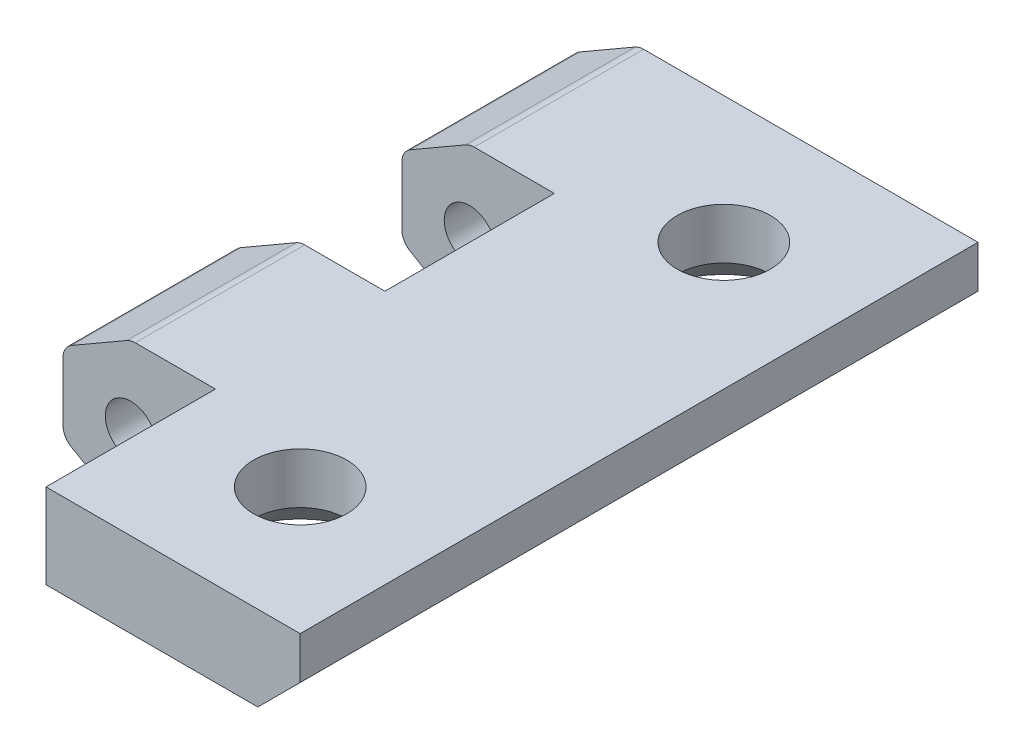
ISO-10303-21;
HEADER;
FILE_DESCRIPTION(('STEP AP214'),'2;1');
FILE_NAME('part.step','',(''),(''),'','','');
FILE_SCHEMA(('AUTOMOTIVE_DESIGN { 1 0 10303 214 1 1 1 1 }'));
ENDSEC;
DATA;
#1=APPLICATION_CONTEXT('core data for automotive mechanical design processes');
#2=APPLICATION_PROTOCOL_DEFINITION('international standard','automotive_design',2000,#1);
#3=PRODUCT_CONTEXT('',#1,'mechanical');
#4=PRODUCT('Part','Part','',(#3));
#5=PRODUCT_RELATED_PRODUCT_CATEGORY('part','',(#4));
#6=PRODUCT_DEFINITION_FORMATION('','',#4);
#7=PRODUCT_DEFINITION_CONTEXT('part definition',#1,'design');
#8=PRODUCT_DEFINITION('design','',#6,#7);
#9=PRODUCT_DEFINITION_SHAPE('','',#8);
#10=(LENGTH_UNIT() NAMED_UNIT(*) SI_UNIT(.MILLI.,.METRE.));
#11=(NAMED_UNIT(*) PLANE_ANGLE_UNIT() SI_UNIT($,.RADIAN.));
#12=(NAMED_UNIT(*) SI_UNIT($,.STERADIAN.) SOLID_ANGLE_UNIT());
#13=UNCERTAINTY_MEASURE_WITH_UNIT(LENGTH_MEASURE(1.E-05),#10,'distance_accuracy_value','');
#14=(GEOMETRIC_REPRESENTATION_CONTEXT(3) GLOBAL_UNCERTAINTY_ASSIGNED_CONTEXT((#13)) GLOBAL_UNIT_ASSIGNED_CONTEXT((#10,
#11,#12)) REPRESENTATION_CONTEXT('',''));
#15=CARTESIAN_POINT('',(0.,0.,0.));
#16=DIRECTION('',(0.,0.,1.));
#17=DIRECTION('',(1.,0.,0.));
#18=AXIS2_PLACEMENT_3D('',#15,#16,#17);
#19=CARTESIAN_POINT('',(4.,0.,40.));
#20=DIRECTION('',(-1.,0.,0.));
#21=DIRECTION('',(0.,-1.,0.));
#22=AXIS2_PLACEMENT_3D('',#19,#20,#21);
#23=PLANE('',#22);
#24=DIRECTION('',(0.,-1.,0.));
#25=VECTOR('',#24,1.);
#26=CARTESIAN_POINT('',(4.,0.,30.));
#27=LINE('',#26,#25);
#28=CARTESIAN_POINT('',(4.,-0.381197846482994,30.));
#29=VERTEX_POINT('',#28);
#30=CARTESIAN_POINT('',(4.,-1.73205080756888,30.));
#31=VERTEX_POINT('',#30);
#32=EDGE_CURVE('E318',#29,#31,#27,.T.);
#33=ORIENTED_EDGE('',*,*,#32,.T.);
#34=DIRECTION('',(0.,0.,-1.));
#35=VECTOR('',#34,1.);
#36=CARTESIAN_POINT('',(4.,-1.73205080756888,40.));
#37=LINE('',#36,#35);
#38=CARTESIAN_POINT('',(4.,-1.73205080756888,20.));
#39=VERTEX_POINT('',#38);
#40=EDGE_CURVE('E45',#31,#39,#37,.T.);
#41=ORIENTED_EDGE('',*,*,#40,.T.);
#42=DIRECTION('',(0.,1.,0.));
#43=VECTOR('',#42,1.);
#44=CARTESIAN_POINT('',(4.,0.,20.));
#45=LINE('',#44,#43);
#46=CARTESIAN_POINT('',(4.,-0.381197846482994,20.));
#47=VERTEX_POINT('',#46);
#48=EDGE_CURVE('E300',#39,#47,#45,.T.);
#49=ORIENTED_EDGE('',*,*,#48,.T.);
#50=DIRECTION('',(0.,0.,-1.));
#51=VECTOR('',#50,1.);
#52=CARTESIAN_POINT('',(4.,-0.381197846482994,40.));
#53=LINE('',#52,#51);
#54=EDGE_CURVE('E374',#29,#47,#53,.T.);
#55=ORIENTED_EDGE('',*,*,#54,.F.);
#56=EDGE_LOOP('',(#33,#41,#49,#55));
#57=FACE_BOUND('',#56,.T.);
#58=ADVANCED_FACE('F37',(#57),#23,.F.);
#59=CARTESIAN_POINT('',(-2.,3.46410161513776,40.));
#60=DIRECTION('',(0.5,-0.866025403784439,0.));
#61=DIRECTION('',(0.866025403784439,0.5,0.));
#62=AXIS2_PLACEMENT_3D('',#59,#60,#61);
#63=PLANE('',#62);
#64=DIRECTION('',(0.866025403784439,0.5,0.));
#65=VECTOR('',#64,1.);
#66=CARTESIAN_POINT('',(-2.,3.46410161513776,30.));
#67=LINE('',#66,#65);
#68=CARTESIAN_POINT('',(-3.5,2.59807621135332,30.));
#69=VERTEX_POINT('',#68);
#70=CARTESIAN_POINT('',(-0.232050807568877,4.48482755730145,30.));
#71=VERTEX_POINT('',#70);
#72=EDGE_CURVE('E315',#69,#71,#67,.T.);
#73=ORIENTED_EDGE('',*,*,#72,.T.);
#74=DIRECTION('',(0.,0.,-1.));
#75=VECTOR('',#74,1.);
#76=CARTESIAN_POINT('',(-0.232050807568877,4.48482755730145,20.));
#77=LINE('',#76,#75);
#78=CARTESIAN_POINT('',(-0.232050807568877,4.48482755730145,20.));
#79=VERTEX_POINT('',#78);
#80=EDGE_CURVE('E400',#71,#79,#77,.T.);
#81=ORIENTED_EDGE('',*,*,#80,.T.);
#82=DIRECTION('',(-0.866025403784439,-0.5,0.));
#83=VECTOR('',#82,1.);
#84=CARTESIAN_POINT('',(-2.,3.46410161513775,20.));
#85=LINE('',#84,#83);
#86=CARTESIAN_POINT('',(-3.5,2.59807621135332,20.));
#87=VERTEX_POINT('',#86);
#88=EDGE_CURVE('E297',#79,#87,#85,.T.);
#89=ORIENTED_EDGE('',*,*,#88,.T.);
#90=DIRECTION('',(0.,0.,-1.));
#91=VECTOR('',#90,1.);
#92=CARTESIAN_POINT('',(-3.5,2.59807621135332,40.));
#93=LINE('',#92,#91);
#94=EDGE_CURVE('E392',#87,#69,#93,.F.);
#95=ORIENTED_EDGE('',*,*,#94,.T.);
#96=EDGE_LOOP('',(#73,#81,#89,#95));
#97=FACE_BOUND('',#96,.T.);
#98=ADVANCED_FACE('F562',(#97),#63,.F.);
#99=CARTESIAN_POINT('',(-4.,0.,40.));
#100=DIRECTION('',(1.,0.,0.));
#101=DIRECTION('',(0.,0.,-1.));
#102=AXIS2_PLACEMENT_3D('',#99,#100,#101);
#103=PLANE('',#102);
#104=DIRECTION('',(0.,1.,0.));
#105=VECTOR('',#104,1.);
#106=CARTESIAN_POINT('',(-4.,0.,30.));
#107=LINE('',#106,#105);
#108=CARTESIAN_POINT('',(-4.,-1.73205080756888,30.));
#109=VERTEX_POINT('',#108);
#110=CARTESIAN_POINT('',(-4.,1.73205080756888,30.));
#111=VERTEX_POINT('',#110);
#112=EDGE_CURVE('E312',#109,#111,#107,.T.);
#113=ORIENTED_EDGE('',*,*,#112,.T.);
#114=DIRECTION('',(0.,0.,-1.));
#115=VECTOR('',#114,1.);
#116=CARTESIAN_POINT('',(-4.,1.73205080756888,40.));
#117=LINE('',#116,#115);
#118=CARTESIAN_POINT('',(-4.,1.73205080756888,20.));
#119=VERTEX_POINT('',#118);
#120=EDGE_CURVE('E451',#111,#119,#117,.T.);
#121=ORIENTED_EDGE('',*,*,#120,.T.);
#122=DIRECTION('',(0.,-1.,0.));
#123=VECTOR('',#122,1.);
#124=CARTESIAN_POINT('',(-4.,0.,20.));
#125=LINE('',#124,#123);
#126=CARTESIAN_POINT('',(-4.,-1.73205080756888,20.));
#127=VERTEX_POINT('',#126);
#128=EDGE_CURVE('E294',#119,#127,#125,.T.);
#129=ORIENTED_EDGE('',*,*,#128,.T.);
#130=DIRECTION('',(0.,0.,-1.));
#131=VECTOR('',#130,1.);
#132=CARTESIAN_POINT('',(-4.,-1.73205080756888,40.));
#133=LINE('',#132,#131);
#134=EDGE_CURVE('E449',#127,#109,#133,.F.);
#135=ORIENTED_EDGE('',*,*,#134,.T.);
#136=EDGE_LOOP('',(#113,#121,#129,#135));
#137=FACE_BOUND('',#136,.T.);
#138=ADVANCED_FACE('F570',(#137),#103,.F.);
#139=CARTESIAN_POINT('',(-2.,-3.46410161513776,40.));
#140=DIRECTION('',(0.5,0.866025403784438,0.));
#141=DIRECTION('',(-0.866025403784439,0.5,0.));
#142=AXIS2_PLACEMENT_3D('',#139,#140,#141);
#143=PLANE('',#142);
#144=DIRECTION('',(-0.866025403784439,0.5,0.));
#145=VECTOR('',#144,1.);
#146=CARTESIAN_POINT('',(-2.,-3.46410161513776,30.));
#147=LINE('',#146,#145);
#148=CARTESIAN_POINT('',(-0.500000000000003,-4.33012701892219,30.));
#149=VERTEX_POINT('',#148);
#150=CARTESIAN_POINT('',(-3.5,-2.59807621135332,30.));
#151=VERTEX_POINT('',#150);
#152=EDGE_CURVE('E309',#149,#151,#147,.T.);
#153=ORIENTED_EDGE('',*,*,#152,.T.);
#154=DIRECTION('',(0.,0.,-1.));
#155=VECTOR('',#154,1.);
#156=CARTESIAN_POINT('',(-3.5,-2.59807621135332,40.));
#157=LINE('',#156,#155);
#158=CARTESIAN_POINT('',(-3.5,-2.59807621135332,20.));
#159=VERTEX_POINT('',#158);
#160=EDGE_CURVE('E466',#151,#159,#157,.T.);
#161=ORIENTED_EDGE('',*,*,#160,.T.);
#162=DIRECTION('',(0.866025403784439,-0.5,0.));
#163=VECTOR('',#162,1.);
#164=CARTESIAN_POINT('',(-2.00000000000001,-3.46410161513775,20.));
#165=LINE('',#164,#163);
#166=CARTESIAN_POINT('',(-0.500000000000003,-4.3301270189222,20.));
#167=VERTEX_POINT('',#166);
#168=EDGE_CURVE('E291',#159,#167,#165,.T.);
#169=ORIENTED_EDGE('',*,*,#168,.T.);
#170=DIRECTION('',(0.,0.,-1.));
#171=VECTOR('',#170,1.);
#172=CARTESIAN_POINT('',(-0.500000000000004,-4.33012701892219,40.));
#173=LINE('',#172,#171);
#174=EDGE_CURVE('E464',#167,#149,#173,.F.);
#175=ORIENTED_EDGE('',*,*,#174,.T.);
#176=EDGE_LOOP('',(#153,#161,#169,#175));
#177=FACE_BOUND('',#176,.T.);
#178=ADVANCED_FACE('F579',(#177),#143,.F.);
#179=CARTESIAN_POINT('',(2.,-3.46410161513776,40.));
#180=DIRECTION('',(-0.5,0.866025403784439,0.));
#181=DIRECTION('',(-0.866025403784439,-0.5,0.));
#182=AXIS2_PLACEMENT_3D('',#179,#180,#181);
#183=PLANE('',#182);
#184=DIRECTION('',(-0.866025403784439,-0.5,0.));
#185=VECTOR('',#184,1.);
#186=CARTESIAN_POINT('',(2.,-3.46410161513776,30.));
#187=LINE('',#186,#185);
#188=CARTESIAN_POINT('',(3.5,-2.59807621135332,30.));
#189=VERTEX_POINT('',#188);
#190=CARTESIAN_POINT('',(0.499999999999997,-4.33012701892219,30.));
#191=VERTEX_POINT('',#190);
#192=EDGE_CURVE('E306',#189,#191,#187,.T.);
#193=ORIENTED_EDGE('',*,*,#192,.T.);
#194=DIRECTION('',(0.,0.,-1.));
#195=VECTOR('',#194,1.);
#196=CARTESIAN_POINT('',(0.499999999999996,-4.3301270189222,40.));
#197=LINE('',#196,#195);
#198=CARTESIAN_POINT('',(0.499999999999997,-4.33012701892219,20.));
#199=VERTEX_POINT('',#198);
#200=EDGE_CURVE('E476',#191,#199,#197,.T.);
#201=ORIENTED_EDGE('',*,*,#200,.T.);
#202=DIRECTION('',(0.866025403784439,0.5,0.));
#203=VECTOR('',#202,1.);
#204=CARTESIAN_POINT('',(1.99999999999999,-3.46410161513776,20.));
#205=LINE('',#204,#203);
#206=CARTESIAN_POINT('',(3.5,-2.59807621135332,20.));
#207=VERTEX_POINT('',#206);
#208=EDGE_CURVE('E288',#199,#207,#205,.T.);
#209=ORIENTED_EDGE('',*,*,#208,.T.);
#210=DIRECTION('',(0.,0.,-1.));
#211=VECTOR('',#210,1.);
#212=CARTESIAN_POINT('',(3.5,-2.59807621135332,40.));
#213=LINE('',#212,#211);
#214=EDGE_CURVE('E474',#207,#189,#213,.F.);
#215=ORIENTED_EDGE('',*,*,#214,.T.);
#216=EDGE_LOOP('',(#193,#201,#209,#215));
#217=FACE_BOUND('',#216,.T.);
#218=ADVANCED_FACE('F587',(#217),#183,.F.);
#219=DIRECTION('',(0.,-1.,0.));
#220=VECTOR('',#219,1.);
#221=CARTESIAN_POINT('',(4.,0.,9.99999999999999));
#222=LINE('',#221,#220);
#223=CARTESIAN_POINT('',(4.,-0.381197846482994,9.99999999999999));
#224=VERTEX_POINT('',#223);
#225=CARTESIAN_POINT('',(4.,-1.73205080756888,9.99999999999999));
#226=VERTEX_POINT('',#225);
#227=EDGE_CURVE('E282',#224,#226,#222,.T.);
#228=ORIENTED_EDGE('',*,*,#227,.T.);
#229=DIRECTION('',(0.,0.,-1.));
#230=VECTOR('',#229,1.);
#231=CARTESIAN_POINT('',(4.,-1.73205080756888,40.));
#232=LINE('',#231,#230);
#233=CARTESIAN_POINT('',(4.,-1.73205080756888,0.));
#234=VERTEX_POINT('',#233);
#235=EDGE_CURVE('E11',#226,#234,#232,.T.);
#236=ORIENTED_EDGE('',*,*,#235,.T.);
#237=DIRECTION('',(0.,1.,0.));
#238=VECTOR('',#237,1.);
#239=CARTESIAN_POINT('',(4.,0.,0.));
#240=LINE('',#239,#238);
#241=CARTESIAN_POINT('',(4.,-0.381197846482994,0.));
#242=VERTEX_POINT('',#241);
#243=EDGE_CURVE('E337',#234,#242,#240,.T.);
#244=ORIENTED_EDGE('',*,*,#243,.T.);
#245=EDGE_CURVE('E371',#224,#242,#53,.T.);
#246=ORIENTED_EDGE('',*,*,#245,.F.);
#247=EDGE_LOOP('',(#228,#236,#244,#246));
#248=FACE_BOUND('',#247,.T.);
#249=ADVANCED_FACE('F550',(#248),#23,.F.);
#250=CARTESIAN_POINT('',(0.,-0.381197846482994,40.));
#251=DIRECTION('',(0.,1.,0.));
#252=DIRECTION('',(0.,0.,1.));
#253=AXIS2_PLACEMENT_3D('',#250,#251,#252);
#254=PLANE('',#253);
#255=CARTESIAN_POINT('',(12.5,-0.381197846482994,7.5));
#256=DIRECTION('',(0.,1.,0.));
#257=DIRECTION('',(0.,0.,1.));
#258=AXIS2_PLACEMENT_3D('',#255,#256,#257);
#259=CIRCLE('',#258,4.75);
#260=CARTESIAN_POINT('',(12.5,-0.381197846482994,12.25));
#261=VERTEX_POINT('',#260);
#262=EDGE_CURVE('E385',#261,#261,#259,.T.);
#263=ORIENTED_EDGE('',*,*,#262,.T.);
#264=EDGE_LOOP('',(#263));
#265=FACE_BOUND('',#264,.T.);
#266=CARTESIAN_POINT('',(12.5,-0.381197846482994,32.5));
#267=DIRECTION('',(0.,1.,0.));
#268=DIRECTION('',(0.,0.,1.));
#269=AXIS2_PLACEMENT_3D('',#266,#267,#268);
#270=CIRCLE('',#269,4.75000000000002);
#271=CARTESIAN_POINT('',(12.5,-0.381197846482994,37.25));
#272=VERTEX_POINT('',#271);
#273=EDGE_CURVE('E382',#272,#272,#270,.T.);
#274=ORIENTED_EDGE('',*,*,#273,.T.);
#275=EDGE_LOOP('',(#274));
#276=FACE_BOUND('',#275,.T.);
#277=DIRECTION('',(1.,0.,0.));
#278=VECTOR('',#277,1.);
#279=CARTESIAN_POINT('',(0.,-0.381197846482994,40.));
#280=LINE('',#279,#278);
#281=CARTESIAN_POINT('',(5.,-0.381197846482994,40.));
#282=VERTEX_POINT('',#281);
#283=CARTESIAN_POINT('',(17.5,-0.381197846482995,40.));
#284=VERTEX_POINT('',#283);
#285=EDGE_CURVE('E326',#282,#284,#280,.T.);
#286=ORIENTED_EDGE('',*,*,#285,.F.);
#287=DIRECTION('',(0.,0.,-1.));
#288=VECTOR('',#287,1.);
#289=CARTESIAN_POINT('',(5.,-0.381197846482994,40.));
#290=LINE('',#289,#288);
#291=CARTESIAN_POINT('',(5.,-0.381197846482994,30.));
#292=VERTEX_POINT('',#291);
#293=EDGE_CURVE('E239',#282,#292,#290,.T.);
#294=ORIENTED_EDGE('',*,*,#293,.T.);
#295=DIRECTION('',(-1.,0.,0.));
#296=VECTOR('',#295,1.);
#297=CARTESIAN_POINT('',(0.,-0.381197846482994,30.));
#298=LINE('',#297,#296);
#299=EDGE_CURVE('E236',#292,#29,#298,.T.);
#300=ORIENTED_EDGE('',*,*,#299,.T.);
#301=ORIENTED_EDGE('',*,*,#54,.T.);
#302=DIRECTION('',(1.,0.,0.));
#303=VECTOR('',#302,1.);
#304=CARTESIAN_POINT('',(0.,-0.381197846482994,20.));
#305=LINE('',#304,#303);
#306=CARTESIAN_POINT('',(5.,-0.381197846482994,20.));
#307=VERTEX_POINT('',#306);
#308=EDGE_CURVE('E302',#47,#307,#305,.T.);
#309=ORIENTED_EDGE('',*,*,#308,.T.);
#310=DIRECTION('',(0.,0.,-1.));
#311=VECTOR('',#310,1.);
#312=CARTESIAN_POINT('',(5.,-0.381197846482994,40.));
#313=LINE('',#312,#311);
#314=CARTESIAN_POINT('',(5.,-0.381197846482994,10.));
#315=VERTEX_POINT('',#314);
#316=EDGE_CURVE('E322',#307,#315,#313,.T.);
#317=ORIENTED_EDGE('',*,*,#316,.T.);
#318=DIRECTION('',(-1.,0.,0.));
#319=VECTOR('',#318,1.);
#320=CARTESIAN_POINT('',(0.,-0.381197846482994,9.99999999999999));
#321=LINE('',#320,#319);
#322=EDGE_CURVE('E284',#315,#224,#321,.T.);
#323=ORIENTED_EDGE('',*,*,#322,.T.);
#324=ORIENTED_EDGE('',*,*,#245,.T.);
#325=DIRECTION('',(1.,0.,0.));
#326=VECTOR('',#325,1.);
#327=CARTESIAN_POINT('',(0.,-0.381197846482994,0.));
#328=LINE('',#327,#326);
#329=CARTESIAN_POINT('',(17.5,-0.381197846482995,0.));
#330=VERTEX_POINT('',#329);
#331=EDGE_CURVE('E339',#242,#330,#328,.T.);
#332=ORIENTED_EDGE('',*,*,#331,.T.);
#333=DIRECTION('',(0.,0.,-1.));
#334=VECTOR('',#333,1.);
#335=CARTESIAN_POINT('',(17.5,-0.381197846482995,40.));
#336=LINE('',#335,#334);
#337=EDGE_CURVE('E368',#284,#330,#336,.T.);
#338=ORIENTED_EDGE('',*,*,#337,.F.);
#339=EDGE_LOOP('',(#286,#294,#300,#301,#309,#317,#323,#324,#332,#338));
#340=FACE_BOUND('',#339,.T.);
#341=ADVANCED_FACE('F494',(#265,#276,#340),#254,.F.);
#342=CARTESIAN_POINT('',(8.9405989232415,-8.9405989232415,40.));
#343=DIRECTION('',(-0.707106781186548,0.707106781186547,0.));
#344=DIRECTION('',(-0.707106781186547,-0.707106781186548,0.));
#345=AXIS2_PLACEMENT_3D('',#342,#343,#344);
#346=PLANE('',#345);
#347=DIRECTION('',(0.707106781186547,0.707106781186548,0.));
#348=VECTOR('',#347,1.);
#349=CARTESIAN_POINT('',(8.9405989232415,-8.9405989232415,0.));
#350=LINE('',#349,#348);
#351=CARTESIAN_POINT('',(20.,2.11880215351701,0.));
#352=VERTEX_POINT('',#351);
#353=EDGE_CURVE('E342',#330,#352,#350,.T.);
#354=ORIENTED_EDGE('',*,*,#353,.T.);
#355=DIRECTION('',(0.,0.,-1.));
#356=VECTOR('',#355,1.);
#357=CARTESIAN_POINT('',(20.,2.11880215351701,40.));
#358=LINE('',#357,#356);
#359=CARTESIAN_POINT('',(20.,2.11880215351701,40.));
#360=VERTEX_POINT('',#359);
#361=EDGE_CURVE('E366',#360,#352,#358,.T.);
#362=ORIENTED_EDGE('',*,*,#361,.F.);
#363=DIRECTION('',(0.707106781186547,0.707106781186548,0.));
#364=VECTOR('',#363,1.);
#365=CARTESIAN_POINT('',(8.9405989232415,-8.9405989232415,40.));
#366=LINE('',#365,#364);
#367=EDGE_CURVE('E328',#284,#360,#366,.T.);
#368=ORIENTED_EDGE('',*,*,#367,.F.);
#369=ORIENTED_EDGE('',*,*,#337,.T.);
#370=EDGE_LOOP('',(#354,#362,#368,#369));
#371=FACE_BOUND('',#370,.T.);
#372=ADVANCED_FACE('F609',(#371),#346,.F.);
#373=CARTESIAN_POINT('',(20.,0.,40.));
#374=DIRECTION('',(1.,0.,0.));
#375=DIRECTION('',(0.,1.,0.));
#376=AXIS2_PLACEMENT_3D('',#373,#374,#375);
#377=PLANE('',#376);
#378=DIRECTION('',(0.,-1.,0.));
#379=VECTOR('',#378,1.);
#380=CARTESIAN_POINT('',(20.,0.,0.));
#381=LINE('',#380,#379);
#382=CARTESIAN_POINT('',(20.,4.61880215351701,0.));
#383=VERTEX_POINT('',#382);
#384=EDGE_CURVE('E345',#383,#352,#381,.T.);
#385=ORIENTED_EDGE('',*,*,#384,.F.);
#386=DIRECTION('',(0.,0.,-1.));
#387=VECTOR('',#386,1.);
#388=CARTESIAN_POINT('',(20.,4.61880215351701,40.));
#389=LINE('',#388,#387);
#390=CARTESIAN_POINT('',(20.,4.61880215351701,40.));
#391=VERTEX_POINT('',#390);
#392=EDGE_CURVE('E336',#391,#383,#389,.T.);
#393=ORIENTED_EDGE('',*,*,#392,.F.);
#394=DIRECTION('',(0.,-1.,0.));
#395=VECTOR('',#394,1.);
#396=CARTESIAN_POINT('',(20.,0.,40.));
#397=LINE('',#396,#395);
#398=EDGE_CURVE('E331',#391,#360,#397,.T.);
#399=ORIENTED_EDGE('',*,*,#398,.T.);
#400=ORIENTED_EDGE('',*,*,#361,.T.);
#401=EDGE_LOOP('',(#385,#393,#399,#400));
#402=FACE_BOUND('',#401,.T.);
#403=ADVANCED_FACE('F503',(#402),#377,.T.);
#404=CARTESIAN_POINT('',(0.,4.61880215351701,40.));
#405=DIRECTION('',(0.,1.,0.));
#406=DIRECTION('',(0.,0.,1.));
#407=AXIS2_PLACEMENT_3D('',#404,#405,#406);
#408=PLANE('',#407);
#409=DIRECTION('',(1.,0.,0.));
#410=VECTOR('',#409,1.);
#411=CARTESIAN_POINT('',(5.,4.61880215351701,20.));
#412=LINE('',#411,#410);
#413=CARTESIAN_POINT('',(0.267949192431122,4.61880215351701,20.));
#414=VERTEX_POINT('',#413);
#415=CARTESIAN_POINT('',(5.,4.61880215351701,20.));
#416=VERTEX_POINT('',#415);
#417=EDGE_CURVE('E263',#414,#416,#412,.T.);
#418=ORIENTED_EDGE('',*,*,#417,.F.);
#419=DIRECTION('',(0.,0.,-1.));
#420=VECTOR('',#419,1.);
#421=CARTESIAN_POINT('',(0.267949192431122,4.61880215351701,30.));
#422=LINE('',#421,#420);
#423=CARTESIAN_POINT('',(0.267949192431122,4.61880215351701,30.));
#424=VERTEX_POINT('',#423);
#425=EDGE_CURVE('E254',#414,#424,#422,.F.);
#426=ORIENTED_EDGE('',*,*,#425,.T.);
#427=DIRECTION('',(-1.,0.,0.));
#428=VECTOR('',#427,1.);
#429=CARTESIAN_POINT('',(5.,4.61880215351701,30.));
#430=LINE('',#429,#428);
#431=CARTESIAN_POINT('',(5.,4.61880215351701,30.));
#432=VERTEX_POINT('',#431);
#433=EDGE_CURVE('E233',#432,#424,#430,.T.);
#434=ORIENTED_EDGE('',*,*,#433,.F.);
#435=DIRECTION('',(0.,0.,-1.));
#436=VECTOR('',#435,1.);
#437=CARTESIAN_POINT('',(5.,4.61880215351701,40.));
#438=LINE('',#437,#436);
#439=CARTESIAN_POINT('',(5.,4.61880215351701,40.));
#440=VERTEX_POINT('',#439);
#441=EDGE_CURVE('E242',#440,#432,#438,.T.);
#442=ORIENTED_EDGE('',*,*,#441,.F.);
#443=DIRECTION('',(1.,0.,0.));
#444=VECTOR('',#443,1.);
#445=CARTESIAN_POINT('',(0.,4.61880215351701,40.));
#446=LINE('',#445,#444);
#447=EDGE_CURVE('E334',#440,#391,#446,.T.);
#448=ORIENTED_EDGE('',*,*,#447,.T.);
#449=ORIENTED_EDGE('',*,*,#392,.T.);
#450=DIRECTION('',(1.,0.,0.));
#451=VECTOR('',#450,1.);
#452=CARTESIAN_POINT('',(0.,4.61880215351701,0.));
#453=LINE('',#452,#451);
#454=CARTESIAN_POINT('',(0.267949192431122,4.61880215351701,0.));
#455=VERTEX_POINT('',#454);
#456=EDGE_CURVE('E348',#455,#383,#453,.T.);
#457=ORIENTED_EDGE('',*,*,#456,.F.);
#458=DIRECTION('',(0.,0.,-1.));
#459=VECTOR('',#458,1.);
#460=CARTESIAN_POINT('',(0.267949192431122,4.61880215351701,9.99999999999999));
#461=LINE('',#460,#459);
#462=CARTESIAN_POINT('',(0.267949192431122,4.61880215351701,10.));
#463=VERTEX_POINT('',#462);
#464=EDGE_CURVE('E413',#455,#463,#461,.F.);
#465=ORIENTED_EDGE('',*,*,#464,.T.);
#466=DIRECTION('',(-1.,0.,0.));
#467=VECTOR('',#466,1.);
#468=CARTESIAN_POINT('',(5.,4.61880215351701,10.));
#469=LINE('',#468,#467);
#470=CARTESIAN_POINT('',(5.,4.61880215351701,10.));
#471=VERTEX_POINT('',#470);
#472=EDGE_CURVE('E260',#471,#463,#469,.T.);
#473=ORIENTED_EDGE('',*,*,#472,.F.);
#474=DIRECTION('',(0.,0.,-1.));
#475=VECTOR('',#474,1.);
#476=CARTESIAN_POINT('',(5.,4.61880215351701,20.));
#477=LINE('',#476,#475);
#478=EDGE_CURVE('E257',#416,#471,#477,.T.);
#479=ORIENTED_EDGE('',*,*,#478,.F.);
#480=EDGE_LOOP('',(#418,#426,#434,#442,#448,#449,#457,#465,#473,#479));
#481=FACE_BOUND('',#480,.T.);
#482=CARTESIAN_POINT('',(12.5,4.61880215351701,32.5));
#483=DIRECTION('',(0.,1.,0.));
#484=DIRECTION('',(0.,0.,1.));
#485=AXIS2_PLACEMENT_3D('',#482,#483,#484);
#486=CIRCLE('',#485,2.75);
#487=CARTESIAN_POINT('',(12.5,4.61880215351701,35.25));
#488=VERTEX_POINT('',#487);
#489=EDGE_CURVE('E340',#488,#488,#486,.T.);
#490=ORIENTED_EDGE('',*,*,#489,.F.);
#491=EDGE_LOOP('',(#490));
#492=FACE_BOUND('',#491,.T.);
#493=CARTESIAN_POINT('',(12.5,4.61880215351701,7.5));
#494=DIRECTION('',(0.,1.,0.));
#495=DIRECTION('',(0.,0.,1.));
#496=AXIS2_PLACEMENT_3D('',#493,#494,#495);
#497=CIRCLE('',#496,2.75);
#498=CARTESIAN_POINT('',(12.5,4.61880215351701,10.25));
#499=VERTEX_POINT('',#498);
#500=EDGE_CURVE('E325',#499,#499,#497,.T.);
#501=ORIENTED_EDGE('',*,*,#500,.F.);
#502=EDGE_LOOP('',(#501));
#503=FACE_BOUND('',#502,.T.);
#504=ADVANCED_FACE('F251',(#481,#492,#503),#408,.T.);
#505=DIRECTION('',(0.866025403784439,0.5,0.));
#506=VECTOR('',#505,1.);
#507=CARTESIAN_POINT('',(-2.,3.46410161513775,9.99999999999999));
#508=LINE('',#507,#506);
#509=CARTESIAN_POINT('',(-3.5,2.59807621135332,9.99999999999999));
#510=VERTEX_POINT('',#509);
#511=CARTESIAN_POINT('',(-0.232050807568877,4.48482755730145,9.99999999999999));
#512=VERTEX_POINT('',#511);
#513=EDGE_CURVE('E279',#510,#512,#508,.T.);
#514=ORIENTED_EDGE('',*,*,#513,.T.);
#515=DIRECTION('',(0.,0.,-1.));
#516=VECTOR('',#515,1.);
#517=CARTESIAN_POINT('',(-0.232050807568877,4.48482755730145,0.));
#518=LINE('',#517,#516);
#519=CARTESIAN_POINT('',(-0.232050807568877,4.48482755730145,0.));
#520=VERTEX_POINT('',#519);
#521=EDGE_CURVE('E428',#512,#520,#518,.T.);
#522=ORIENTED_EDGE('',*,*,#521,.T.);
#523=DIRECTION('',(-0.866025403784439,-0.5,0.));
#524=VECTOR('',#523,1.);
#525=CARTESIAN_POINT('',(-2.,3.46410161513776,0.));
#526=LINE('',#525,#524);
#527=CARTESIAN_POINT('',(-3.5,2.59807621135332,0.));
#528=VERTEX_POINT('',#527);
#529=EDGE_CURVE('E350',#520,#528,#526,.T.);
#530=ORIENTED_EDGE('',*,*,#529,.T.);
#531=DIRECTION('',(0.,0.,-1.));
#532=VECTOR('',#531,1.);
#533=CARTESIAN_POINT('',(-3.5,2.59807621135332,40.));
#534=LINE('',#533,#532);
#535=EDGE_CURVE('E426',#528,#510,#534,.F.);
#536=ORIENTED_EDGE('',*,*,#535,.T.);
#537=EDGE_LOOP('',(#514,#522,#530,#536));
#538=FACE_BOUND('',#537,.T.);
#539=ADVANCED_FACE('F521',(#538),#63,.F.);
#540=DIRECTION('',(0.,1.,0.));
#541=VECTOR('',#540,1.);
#542=CARTESIAN_POINT('',(-4.,0.,9.99999999999999));
#543=LINE('',#542,#541);
#544=CARTESIAN_POINT('',(-4.,-1.73205080756888,9.99999999999999));
#545=VERTEX_POINT('',#544);
#546=CARTESIAN_POINT('',(-4.,1.73205080756888,9.99999999999999));
#547=VERTEX_POINT('',#546);
#548=EDGE_CURVE('E276',#545,#547,#543,.T.);
#549=ORIENTED_EDGE('',*,*,#548,.T.);
#550=DIRECTION('',(0.,0.,-1.));
#551=VECTOR('',#550,1.);
#552=CARTESIAN_POINT('',(-4.,1.73205080756888,40.));
#553=LINE('',#552,#551);
#554=CARTESIAN_POINT('',(-4.,1.73205080756888,0.));
#555=VERTEX_POINT('',#554);
#556=EDGE_CURVE('E456',#547,#555,#553,.T.);
#557=ORIENTED_EDGE('',*,*,#556,.T.);
#558=DIRECTION('',(0.,-1.,0.));
#559=VECTOR('',#558,1.);
#560=CARTESIAN_POINT('',(-4.,0.,0.));
#561=LINE('',#560,#559);
#562=CARTESIAN_POINT('',(-4.,-1.73205080756888,0.));
#563=VERTEX_POINT('',#562);
#564=EDGE_CURVE('E353',#555,#563,#561,.T.);
#565=ORIENTED_EDGE('',*,*,#564,.T.);
#566=DIRECTION('',(0.,0.,-1.));
#567=VECTOR('',#566,1.);
#568=CARTESIAN_POINT('',(-4.,-1.73205080756888,40.));
#569=LINE('',#568,#567);
#570=EDGE_CURVE('E454',#563,#545,#569,.F.);
#571=ORIENTED_EDGE('',*,*,#570,.T.);
#572=EDGE_LOOP('',(#549,#557,#565,#571));
#573=FACE_BOUND('',#572,.T.);
#574=ADVANCED_FACE('F529',(#573),#103,.F.);
#575=DIRECTION('',(-0.866025403784439,0.5,0.));
#576=VECTOR('',#575,1.);
#577=CARTESIAN_POINT('',(-2.,-3.46410161513775,9.99999999999999));
#578=LINE('',#577,#576);
#579=CARTESIAN_POINT('',(-0.500000000000003,-4.33012701892219,9.99999999999999));
#580=VERTEX_POINT('',#579);
#581=CARTESIAN_POINT('',(-3.5,-2.59807621135332,9.99999999999999));
#582=VERTEX_POINT('',#581);
#583=EDGE_CURVE('E273',#580,#582,#578,.T.);
#584=ORIENTED_EDGE('',*,*,#583,.T.);
#585=DIRECTION('',(0.,0.,-1.));
#586=VECTOR('',#585,1.);
#587=CARTESIAN_POINT('',(-3.5,-2.59807621135332,40.));
#588=LINE('',#587,#586);
#589=CARTESIAN_POINT('',(-3.5,-2.59807621135332,0.));
#590=VERTEX_POINT('',#589);
#591=EDGE_CURVE('E461',#582,#590,#588,.T.);
#592=ORIENTED_EDGE('',*,*,#591,.T.);
#593=DIRECTION('',(0.866025403784439,-0.5,0.));
#594=VECTOR('',#593,1.);
#595=CARTESIAN_POINT('',(-2.,-3.46410161513776,0.));
#596=LINE('',#595,#594);
#597=CARTESIAN_POINT('',(-0.500000000000003,-4.33012701892219,0.));
#598=VERTEX_POINT('',#597);
#599=EDGE_CURVE('E356',#590,#598,#596,.T.);
#600=ORIENTED_EDGE('',*,*,#599,.T.);
#601=DIRECTION('',(0.,0.,-1.));
#602=VECTOR('',#601,1.);
#603=CARTESIAN_POINT('',(-0.500000000000004,-4.33012701892219,40.));
#604=LINE('',#603,#602);
#605=EDGE_CURVE('E459',#598,#580,#604,.F.);
#606=ORIENTED_EDGE('',*,*,#605,.T.);
#607=EDGE_LOOP('',(#584,#592,#600,#606));
#608=FACE_BOUND('',#607,.T.);
#609=ADVANCED_FACE('F536',(#608),#143,.F.);
#610=DIRECTION('',(-0.866025403784439,-0.5,0.));
#611=VECTOR('',#610,1.);
#612=CARTESIAN_POINT('',(2.,-3.46410161513776,9.99999999999999));
#613=LINE('',#612,#611);
#614=CARTESIAN_POINT('',(3.5,-2.59807621135332,9.99999999999999));
#615=VERTEX_POINT('',#614);
#616=CARTESIAN_POINT('',(0.499999999999997,-4.33012701892219,9.99999999999999));
#617=VERTEX_POINT('',#616);
#618=EDGE_CURVE('E271',#615,#617,#613,.T.);
#619=ORIENTED_EDGE('',*,*,#618,.T.);
#620=DIRECTION('',(0.,0.,-1.));
#621=VECTOR('',#620,1.);
#622=CARTESIAN_POINT('',(0.499999999999996,-4.3301270189222,40.));
#623=LINE('',#622,#621);
#624=CARTESIAN_POINT('',(0.499999999999997,-4.33012701892219,0.));
#625=VERTEX_POINT('',#624);
#626=EDGE_CURVE('E471',#617,#625,#623,.T.);
#627=ORIENTED_EDGE('',*,*,#626,.T.);
#628=DIRECTION('',(0.866025403784439,0.5,0.));
#629=VECTOR('',#628,1.);
#630=CARTESIAN_POINT('',(2.,-3.46410161513776,0.));
#631=LINE('',#630,#629);
#632=CARTESIAN_POINT('',(3.5,-2.59807621135332,0.));
#633=VERTEX_POINT('',#632);
#634=EDGE_CURVE('E359',#625,#633,#631,.T.);
#635=ORIENTED_EDGE('',*,*,#634,.T.);
#636=DIRECTION('',(0.,0.,-1.));
#637=VECTOR('',#636,1.);
#638=CARTESIAN_POINT('',(3.5,-2.59807621135332,40.));
#639=LINE('',#638,#637);
#640=EDGE_CURVE('E469',#633,#615,#639,.F.);
#641=ORIENTED_EDGE('',*,*,#640,.T.);
#642=EDGE_LOOP('',(#619,#627,#635,#641));
#643=FACE_BOUND('',#642,.T.);
#644=ADVANCED_FACE('F544',(#643),#183,.F.);
#645=CARTESIAN_POINT('',(0.,0.,40.));
#646=DIRECTION('',(0.,0.,-1.));
#647=DIRECTION('',(-1.,0.,0.));
#648=AXIS2_PLACEMENT_3D('',#645,#646,#647);
#649=CYLINDRICAL_SURFACE('',#648,1.5);
#650=CARTESIAN_POINT('',(0.,0.,9.99999999999999));
#651=DIRECTION('',(0.,0.,-1.));
#652=DIRECTION('',(-1.,0.,0.));
#653=AXIS2_PLACEMENT_3D('',#650,#651,#652);
#654=CIRCLE('',#653,1.5);
#655=CARTESIAN_POINT('',(-1.5,0.,9.99999999999999));
#656=VERTEX_POINT('',#655);
#657=EDGE_CURVE('E270',#656,#656,#654,.T.);
#658=ORIENTED_EDGE('',*,*,#657,.F.);
#659=EDGE_LOOP('',(#658));
#660=FACE_BOUND('',#659,.T.);
#661=CARTESIAN_POINT('',(0.,0.,0.));
#662=DIRECTION('',(0.,0.,1.));
#663=DIRECTION('',(1.,0.,0.));
#664=AXIS2_PLACEMENT_3D('',#661,#662,#663);
#665=CIRCLE('',#664,1.5);
#666=CARTESIAN_POINT('',(1.5,0.,0.));
#667=VERTEX_POINT('',#666);
#668=EDGE_CURVE('E329',#667,#667,#665,.T.);
#669=ORIENTED_EDGE('',*,*,#668,.F.);
#670=EDGE_LOOP('',(#669));
#671=FACE_BOUND('',#670,.T.);
#672=ADVANCED_FACE('F618',(#660,#671),#649,.F.);
#673=CARTESIAN_POINT('',(0.,0.,40.));
#674=DIRECTION('',(0.,0.,1.));
#675=DIRECTION('',(1.,0.,0.));
#676=AXIS2_PLACEMENT_3D('',#673,#674,#675);
#677=PLANE('',#676);
#678=DIRECTION('',(0.,1.,0.));
#679=VECTOR('',#678,1.);
#680=CARTESIAN_POINT('',(5.,0.,40.));
#681=LINE('',#680,#679);
#682=EDGE_CURVE('E245',#282,#440,#681,.T.);
#683=ORIENTED_EDGE('',*,*,#682,.F.);
#684=ORIENTED_EDGE('',*,*,#285,.T.);
#685=ORIENTED_EDGE('',*,*,#367,.T.);
#686=ORIENTED_EDGE('',*,*,#398,.F.);
#687=ORIENTED_EDGE('',*,*,#447,.F.);
#688=EDGE_LOOP('',(#683,#684,#685,#686,#687));
#689=FACE_BOUND('',#688,.T.);
#690=ADVANCED_FACE('F497',(#689),#677,.T.);
#691=CARTESIAN_POINT('',(0.,0.,0.));
#692=DIRECTION('',(0.,0.,1.));
#693=DIRECTION('',(1.,0.,0.));
#694=AXIS2_PLACEMENT_3D('',#691,#692,#693);
#695=PLANE('',#694);
#696=ORIENTED_EDGE('',*,*,#529,.F.);
#697=CARTESIAN_POINT('',(0.267949192431122,3.61880215351701,0.));
#698=DIRECTION('',(0.,0.,1.));
#699=DIRECTION('',(1.,0.,0.));
#700=AXIS2_PLACEMENT_3D('',#697,#698,#699);
#701=CIRCLE('',#700,1.);
#702=EDGE_CURVE('E439',#520,#455,#701,.F.);
#703=ORIENTED_EDGE('',*,*,#702,.T.);
#704=ORIENTED_EDGE('',*,*,#456,.T.);
#705=ORIENTED_EDGE('',*,*,#384,.T.);
#706=ORIENTED_EDGE('',*,*,#353,.F.);
#707=ORIENTED_EDGE('',*,*,#331,.F.);
#708=ORIENTED_EDGE('',*,*,#243,.F.);
#709=CARTESIAN_POINT('',(3.,-1.73205080756888,0.));
#710=DIRECTION('',(0.,0.,1.));
#711=DIRECTION('',(1.,0.,0.));
#712=AXIS2_PLACEMENT_3D('',#709,#710,#711);
#713=CIRCLE('',#712,1.);
#714=EDGE_CURVE('E431',#234,#633,#713,.F.);
#715=ORIENTED_EDGE('',*,*,#714,.T.);
#716=ORIENTED_EDGE('',*,*,#634,.F.);
#717=CARTESIAN_POINT('',(0.,-3.46410161513776,0.));
#718=DIRECTION('',(0.,0.,1.));
#719=DIRECTION('',(1.,0.,0.));
#720=AXIS2_PLACEMENT_3D('',#717,#718,#719);
#721=CIRCLE('',#720,1.);
#722=EDGE_CURVE('E433',#625,#598,#721,.F.);
#723=ORIENTED_EDGE('',*,*,#722,.T.);
#724=ORIENTED_EDGE('',*,*,#599,.F.);
#725=CARTESIAN_POINT('',(-3.,-1.73205080756888,0.));
#726=DIRECTION('',(0.,0.,1.));
#727=DIRECTION('',(1.,0.,0.));
#728=AXIS2_PLACEMENT_3D('',#725,#726,#727);
#729=CIRCLE('',#728,1.);
#730=EDGE_CURVE('E435',#590,#563,#729,.F.);
#731=ORIENTED_EDGE('',*,*,#730,.T.);
#732=ORIENTED_EDGE('',*,*,#564,.F.);
#733=CARTESIAN_POINT('',(-3.,1.73205080756888,0.));
#734=DIRECTION('',(0.,0.,1.));
#735=DIRECTION('',(1.,0.,0.));
#736=AXIS2_PLACEMENT_3D('',#733,#734,#735);
#737=CIRCLE('',#736,1.);
#738=EDGE_CURVE('E437',#555,#528,#737,.F.);
#739=ORIENTED_EDGE('',*,*,#738,.T.);
#740=EDGE_LOOP('',(#696,#703,#704,#705,#706,#707,#708,#715,#716,#723,#724,#731,#732,#739));
#741=FACE_BOUND('',#740,.T.);
#742=ORIENTED_EDGE('',*,*,#668,.T.);
#743=EDGE_LOOP('',(#742));
#744=FACE_BOUND('',#743,.T.);
#745=ADVANCED_FACE('F508',(#741,#744),#695,.F.);
#746=CARTESIAN_POINT('',(12.5,9.61880215351701,7.5));
#747=DIRECTION('',(0.,-1.,0.));
#748=DIRECTION('',(0.,0.,-1.));
#749=AXIS2_PLACEMENT_3D('',#746,#747,#748);
#750=CYLINDRICAL_SURFACE('',#749,2.75);
#751=CARTESIAN_POINT('',(12.5,1.61880215351701,7.5));
#752=DIRECTION('',(0.,1.,0.));
#753=DIRECTION('',(0.,0.,1.));
#754=AXIS2_PLACEMENT_3D('',#751,#752,#753);
#755=CIRCLE('',#754,2.75);
#756=CARTESIAN_POINT('',(12.5,1.61880215351701,10.25));
#757=VERTEX_POINT('',#756);
#758=EDGE_CURVE('E379',#757,#757,#755,.F.);
#759=ORIENTED_EDGE('',*,*,#758,.T.);
#760=EDGE_LOOP('',(#759));
#761=FACE_BOUND('',#760,.T.);
#762=ORIENTED_EDGE('',*,*,#500,.T.);
#763=EDGE_LOOP('',(#762));
#764=FACE_BOUND('',#763,.T.);
#765=ADVANCED_FACE('F677',(#761,#764),#750,.F.);
#766=CARTESIAN_POINT('',(12.5,9.61880215351701,32.5));
#767=DIRECTION('',(0.,-1.,0.));
#768=DIRECTION('',(0.,0.,-1.));
#769=AXIS2_PLACEMENT_3D('',#766,#767,#768);
#770=CYLINDRICAL_SURFACE('',#769,2.75);
#771=CARTESIAN_POINT('',(12.5,1.61880215351701,32.5));
#772=DIRECTION('',(0.,1.,0.));
#773=DIRECTION('',(0.,0.,1.));
#774=AXIS2_PLACEMENT_3D('',#771,#772,#773);
#775=CIRCLE('',#774,2.75);
#776=CARTESIAN_POINT('',(12.5,1.61880215351701,35.25));
#777=VERTEX_POINT('',#776);
#778=EDGE_CURVE('E388',#777,#777,#775,.F.);
#779=ORIENTED_EDGE('',*,*,#778,.T.);
#780=EDGE_LOOP('',(#779));
#781=FACE_BOUND('',#780,.T.);
#782=ORIENTED_EDGE('',*,*,#489,.T.);
#783=EDGE_LOOP('',(#782));
#784=FACE_BOUND('',#783,.T.);
#785=ADVANCED_FACE('F796',(#781,#784),#770,.F.);
#786=CARTESIAN_POINT('',(12.5,1.61880215351701,7.5));
#787=DIRECTION('',(0.,-1.,0.));
#788=DIRECTION('',(0.,0.,-1.));
#789=AXIS2_PLACEMENT_3D('',#786,#787,#788);
#790=CONICAL_SURFACE('',#789,2.75,0.785398163397449);
#791=ORIENTED_EDGE('',*,*,#262,.F.);
#792=EDGE_LOOP('',(#791));
#793=FACE_BOUND('',#792,.T.);
#794=ORIENTED_EDGE('',*,*,#758,.F.);
#795=EDGE_LOOP('',(#794));
#796=FACE_BOUND('',#795,.T.);
#797=ADVANCED_FACE('F793',(#793,#796),#790,.F.);
#798=CARTESIAN_POINT('',(12.5,1.61880215351701,32.5));
#799=DIRECTION('',(0.,-1.,0.));
#800=DIRECTION('',(0.,0.,-1.));
#801=AXIS2_PLACEMENT_3D('',#798,#799,#800);
#802=CONICAL_SURFACE('',#801,2.75,0.785398163397451);
#803=ORIENTED_EDGE('',*,*,#273,.F.);
#804=EDGE_LOOP('',(#803));
#805=FACE_BOUND('',#804,.T.);
#806=ORIENTED_EDGE('',*,*,#778,.F.);
#807=EDGE_LOOP('',(#806));
#808=FACE_BOUND('',#807,.T.);
#809=ADVANCED_FACE('F690',(#805,#808),#802,.F.);
#810=CARTESIAN_POINT('',(5.,-5.38119784648299,30.));
#811=DIRECTION('',(0.,0.,-1.));
#812=DIRECTION('',(-1.,0.,0.));
#813=AXIS2_PLACEMENT_3D('',#810,#811,#812);
#814=PLANE('',#813);
#815=CARTESIAN_POINT('',(0.,0.,30.));
#816=DIRECTION('',(0.,0.,-1.));
#817=DIRECTION('',(-1.,0.,0.));
#818=AXIS2_PLACEMENT_3D('',#815,#816,#817);
#819=CIRCLE('',#818,1.5);
#820=CARTESIAN_POINT('',(-1.5,0.,30.));
#821=VERTEX_POINT('',#820);
#822=EDGE_CURVE('E305',#821,#821,#819,.T.);
#823=ORIENTED_EDGE('',*,*,#822,.T.);
#824=EDGE_LOOP('',(#823));
#825=FACE_BOUND('',#824,.T.);
#826=ORIENTED_EDGE('',*,*,#433,.T.);
#827=CARTESIAN_POINT('',(0.267949192431122,3.61880215351701,30.));
#828=DIRECTION('',(0.,0.,-1.));
#829=DIRECTION('',(-1.,0.,0.));
#830=AXIS2_PLACEMENT_3D('',#827,#828,#829);
#831=CIRCLE('',#830,1.);
#832=EDGE_CURVE('E424',#424,#71,#831,.F.);
#833=ORIENTED_EDGE('',*,*,#832,.T.);
#834=ORIENTED_EDGE('',*,*,#72,.F.);
#835=CARTESIAN_POINT('',(-3.,1.73205080756888,30.));
#836=DIRECTION('',(0.,0.,-1.));
#837=DIRECTION('',(-1.,0.,0.));
#838=AXIS2_PLACEMENT_3D('',#835,#836,#837);
#839=CIRCLE('',#838,1.);
#840=EDGE_CURVE('E422',#69,#111,#839,.F.);
#841=ORIENTED_EDGE('',*,*,#840,.T.);
#842=ORIENTED_EDGE('',*,*,#112,.F.);
#843=CARTESIAN_POINT('',(-3.,-1.73205080756888,30.));
#844=DIRECTION('',(0.,0.,-1.));
#845=DIRECTION('',(-1.,0.,0.));
#846=AXIS2_PLACEMENT_3D('',#843,#844,#845);
#847=CIRCLE('',#846,1.);
#848=EDGE_CURVE('E420',#109,#151,#847,.F.);
#849=ORIENTED_EDGE('',*,*,#848,.T.);
#850=ORIENTED_EDGE('',*,*,#152,.F.);
#851=CARTESIAN_POINT('',(0.,-3.46410161513776,30.));
#852=DIRECTION('',(0.,0.,-1.));
#853=DIRECTION('',(-1.,0.,0.));
#854=AXIS2_PLACEMENT_3D('',#851,#852,#853);
#855=CIRCLE('',#854,1.);
#856=EDGE_CURVE('E418',#149,#191,#855,.F.);
#857=ORIENTED_EDGE('',*,*,#856,.T.);
#858=ORIENTED_EDGE('',*,*,#192,.F.);
#859=CARTESIAN_POINT('',(3.,-1.73205080756888,30.));
#860=DIRECTION('',(0.,0.,-1.));
#861=DIRECTION('',(-1.,0.,0.));
#862=AXIS2_PLACEMENT_3D('',#859,#860,#861);
#863=CIRCLE('',#862,1.);
#864=EDGE_CURVE('E416',#189,#31,#863,.F.);
#865=ORIENTED_EDGE('',*,*,#864,.T.);
#866=ORIENTED_EDGE('',*,*,#32,.F.);
#867=ORIENTED_EDGE('',*,*,#299,.F.);
#868=DIRECTION('',(0.,1.,0.));
#869=VECTOR('',#868,1.);
#870=CARTESIAN_POINT('',(5.,-5.38119784648299,30.));
#871=LINE('',#870,#869);
#872=EDGE_CURVE('E229',#292,#432,#871,.T.);
#873=ORIENTED_EDGE('',*,*,#872,.T.);
#874=EDGE_LOOP('',(#826,#833,#834,#841,#842,#849,#850,#857,#858,#865,#866,#867,#873));
#875=FACE_BOUND('',#874,.T.);
#876=ADVANCED_FACE('F231',(#825,#875),#814,.F.);
#877=CARTESIAN_POINT('',(5.,-5.38119784648299,40.));
#878=DIRECTION('',(1.,0.,0.));
#879=DIRECTION('',(0.,0.,-1.));
#880=AXIS2_PLACEMENT_3D('',#877,#878,#879);
#881=PLANE('',#880);
#882=ORIENTED_EDGE('',*,*,#682,.T.);
#883=ORIENTED_EDGE('',*,*,#441,.T.);
#884=ORIENTED_EDGE('',*,*,#872,.F.);
#885=ORIENTED_EDGE('',*,*,#293,.F.);
#886=EDGE_LOOP('',(#882,#883,#884,#885));
#887=FACE_BOUND('',#886,.T.);
#888=ADVANCED_FACE('F243',(#887),#881,.F.);
#889=CARTESIAN_POINT('',(5.,-5.38119784648299,20.));
#890=DIRECTION('',(1.,0.,0.));
#891=DIRECTION('',(0.,0.,-1.));
#892=AXIS2_PLACEMENT_3D('',#889,#890,#891);
#893=PLANE('',#892);
#894=DIRECTION('',(0.,1.,0.));
#895=VECTOR('',#894,1.);
#896=CARTESIAN_POINT('',(5.,-5.38119784648299,20.));
#897=LINE('',#896,#895);
#898=EDGE_CURVE('E248',#307,#416,#897,.T.);
#899=ORIENTED_EDGE('',*,*,#898,.T.);
#900=ORIENTED_EDGE('',*,*,#478,.T.);
#901=DIRECTION('',(0.,1.,0.));
#902=VECTOR('',#901,1.);
#903=CARTESIAN_POINT('',(5.,-5.38119784648299,10.));
#904=LINE('',#903,#902);
#905=EDGE_CURVE('E265',#315,#471,#904,.T.);
#906=ORIENTED_EDGE('',*,*,#905,.F.);
#907=ORIENTED_EDGE('',*,*,#316,.F.);
#908=EDGE_LOOP('',(#899,#900,#906,#907));
#909=FACE_BOUND('',#908,.T.);
#910=ADVANCED_FACE('F554',(#909),#893,.F.);
#911=CARTESIAN_POINT('',(5.,-5.38119784648299,20.));
#912=DIRECTION('',(0.,0.,1.));
#913=DIRECTION('',(1.,0.,0.));
#914=AXIS2_PLACEMENT_3D('',#911,#912,#913);
#915=PLANE('',#914);
#916=CARTESIAN_POINT('',(0.,0.,20.));
#917=DIRECTION('',(0.,0.,1.));
#918=DIRECTION('',(1.,0.,0.));
#919=AXIS2_PLACEMENT_3D('',#916,#917,#918);
#920=CIRCLE('',#919,1.5);
#921=CARTESIAN_POINT('',(1.5,0.,20.));
#922=VERTEX_POINT('',#921);
#923=EDGE_CURVE('E287',#922,#922,#920,.T.);
#924=ORIENTED_EDGE('',*,*,#923,.T.);
#925=EDGE_LOOP('',(#924));
#926=FACE_BOUND('',#925,.T.);
#927=ORIENTED_EDGE('',*,*,#88,.F.);
#928=CARTESIAN_POINT('',(0.267949192431122,3.61880215351701,20.));
#929=DIRECTION('',(0.,0.,1.));
#930=DIRECTION('',(1.,0.,0.));
#931=AXIS2_PLACEMENT_3D('',#928,#929,#930);
#932=CIRCLE('',#931,1.);
#933=EDGE_CURVE('E411',#79,#414,#932,.F.);
#934=ORIENTED_EDGE('',*,*,#933,.T.);
#935=ORIENTED_EDGE('',*,*,#417,.T.);
#936=ORIENTED_EDGE('',*,*,#898,.F.);
#937=ORIENTED_EDGE('',*,*,#308,.F.);
#938=ORIENTED_EDGE('',*,*,#48,.F.);
#939=CARTESIAN_POINT('',(3.,-1.73205080756888,20.));
#940=DIRECTION('',(0.,0.,1.));
#941=DIRECTION('',(1.,0.,0.));
#942=AXIS2_PLACEMENT_3D('',#939,#940,#941);
#943=CIRCLE('',#942,1.);
#944=EDGE_CURVE('E403',#39,#207,#943,.F.);
#945=ORIENTED_EDGE('',*,*,#944,.T.);
#946=ORIENTED_EDGE('',*,*,#208,.F.);
#947=CARTESIAN_POINT('',(0.,-3.46410161513776,20.));
#948=DIRECTION('',(0.,0.,1.));
#949=DIRECTION('',(1.,0.,0.));
#950=AXIS2_PLACEMENT_3D('',#947,#948,#949);
#951=CIRCLE('',#950,1.);
#952=EDGE_CURVE('E405',#199,#167,#951,.F.);
#953=ORIENTED_EDGE('',*,*,#952,.T.);
#954=ORIENTED_EDGE('',*,*,#168,.F.);
#955=CARTESIAN_POINT('',(-3.,-1.73205080756888,20.));
#956=DIRECTION('',(0.,0.,1.));
#957=DIRECTION('',(1.,0.,0.));
#958=AXIS2_PLACEMENT_3D('',#955,#956,#957);
#959=CIRCLE('',#958,1.);
#960=EDGE_CURVE('E407',#159,#127,#959,.F.);
#961=ORIENTED_EDGE('',*,*,#960,.T.);
#962=ORIENTED_EDGE('',*,*,#128,.F.);
#963=CARTESIAN_POINT('',(-3.,1.73205080756888,20.));
#964=DIRECTION('',(0.,0.,1.));
#965=DIRECTION('',(1.,0.,0.));
#966=AXIS2_PLACEMENT_3D('',#963,#964,#965);
#967=CIRCLE('',#966,1.);
#968=EDGE_CURVE('E409',#119,#87,#967,.F.);
#969=ORIENTED_EDGE('',*,*,#968,.T.);
#970=EDGE_LOOP('',(#927,#934,#935,#936,#937,#938,#945,#946,#953,#954,#961,#962,#969));
#971=FACE_BOUND('',#970,.T.);
#972=ADVANCED_FACE('F488',(#926,#971),#915,.F.);
#973=CARTESIAN_POINT('',(5.,-5.38119784648299,10.));
#974=DIRECTION('',(0.,0.,-1.));
#975=DIRECTION('',(-1.,0.,0.));
#976=AXIS2_PLACEMENT_3D('',#973,#974,#975);
#977=PLANE('',#976);
#978=ORIENTED_EDGE('',*,*,#657,.T.);
#979=EDGE_LOOP('',(#978));
#980=FACE_BOUND('',#979,.T.);
#981=ORIENTED_EDGE('',*,*,#472,.T.);
#982=CARTESIAN_POINT('',(0.267949192431122,3.61880215351701,9.99999999999999));
#983=DIRECTION('',(0.,0.,-1.));
#984=DIRECTION('',(-1.,0.,0.));
#985=AXIS2_PLACEMENT_3D('',#982,#983,#984);
#986=CIRCLE('',#985,1.);
#987=EDGE_CURVE('E447',#463,#512,#986,.F.);
#988=ORIENTED_EDGE('',*,*,#987,.T.);
#989=ORIENTED_EDGE('',*,*,#513,.F.);
#990=CARTESIAN_POINT('',(-3.,1.73205080756888,9.99999999999999));
#991=DIRECTION('',(0.,0.,-1.));
#992=DIRECTION('',(-1.,0.,0.));
#993=AXIS2_PLACEMENT_3D('',#990,#991,#992);
#994=CIRCLE('',#993,1.);
#995=EDGE_CURVE('E445',#510,#547,#994,.F.);
#996=ORIENTED_EDGE('',*,*,#995,.T.);
#997=ORIENTED_EDGE('',*,*,#548,.F.);
#998=CARTESIAN_POINT('',(-3.,-1.73205080756888,9.99999999999999));
#999=DIRECTION('',(0.,0.,-1.));
#1000=DIRECTION('',(-1.,0.,0.));
#1001=AXIS2_PLACEMENT_3D('',#998,#999,#1000);
#1002=CIRCLE('',#1001,1.);
#1003=EDGE_CURVE('E443',#545,#582,#1002,.F.);
#1004=ORIENTED_EDGE('',*,*,#1003,.T.);
#1005=ORIENTED_EDGE('',*,*,#583,.F.);
#1006=CARTESIAN_POINT('',(0.,-3.46410161513776,9.99999999999999));
#1007=DIRECTION('',(0.,0.,-1.));
#1008=DIRECTION('',(-1.,0.,0.));
#1009=AXIS2_PLACEMENT_3D('',#1006,#1007,#1008);
#1010=CIRCLE('',#1009,1.);
#1011=EDGE_CURVE('E58',#580,#617,#1010,.F.);
#1012=ORIENTED_EDGE('',*,*,#1011,.T.);
#1013=ORIENTED_EDGE('',*,*,#618,.F.);
#1014=CARTESIAN_POINT('',(3.,-1.73205080756888,9.99999999999999));
#1015=DIRECTION('',(0.,0.,-1.));
#1016=DIRECTION('',(-1.,0.,0.));
#1017=AXIS2_PLACEMENT_3D('',#1014,#1015,#1016);
#1018=CIRCLE('',#1017,1.);
#1019=EDGE_CURVE('E52',#615,#226,#1018,.F.);
#1020=ORIENTED_EDGE('',*,*,#1019,.T.);
#1021=ORIENTED_EDGE('',*,*,#227,.F.);
#1022=ORIENTED_EDGE('',*,*,#322,.F.);
#1023=ORIENTED_EDGE('',*,*,#905,.T.);
#1024=EDGE_LOOP('',(#981,#988,#989,#996,#997,#1004,#1005,#1012,#1013,#1020,#1021,#1022,#1023));
#1025=FACE_BOUND('',#1024,.T.);
#1026=ADVANCED_FACE('F518',(#980,#1025),#977,.F.);
#1027=ORIENTED_EDGE('',*,*,#822,.F.);
#1028=EDGE_LOOP('',(#1027));
#1029=FACE_BOUND('',#1028,.T.);
#1030=ORIENTED_EDGE('',*,*,#923,.F.);
#1031=EDGE_LOOP('',(#1030));
#1032=FACE_BOUND('',#1031,.T.);
#1033=ADVANCED_FACE('F624',(#1029,#1032),#649,.F.);
#1034=CARTESIAN_POINT('',(0.267949192431122,3.61880215351701,40.));
#1035=DIRECTION('',(0.,0.,1.));
#1036=DIRECTION('',(1.,0.,0.));
#1037=AXIS2_PLACEMENT_3D('',#1034,#1035,#1036);
#1038=CYLINDRICAL_SURFACE('',#1037,1.);
#1039=ORIENTED_EDGE('',*,*,#832,.F.);
#1040=ORIENTED_EDGE('',*,*,#425,.F.);
#1041=ORIENTED_EDGE('',*,*,#933,.F.);
#1042=ORIENTED_EDGE('',*,*,#80,.F.);
#1043=EDGE_LOOP('',(#1039,#1040,#1041,#1042));
#1044=FACE_BOUND('',#1043,.T.);
#1045=ADVANCED_FACE('F557',(#1044),#1038,.T.);
#1046=CARTESIAN_POINT('',(0.267949192431122,3.61880215351701,40.));
#1047=DIRECTION('',(0.,0.,1.));
#1048=DIRECTION('',(1.,0.,0.));
#1049=AXIS2_PLACEMENT_3D('',#1046,#1047,#1048);
#1050=CYLINDRICAL_SURFACE('',#1049,1.);
#1051=ORIENTED_EDGE('',*,*,#987,.F.);
#1052=ORIENTED_EDGE('',*,*,#464,.F.);
#1053=ORIENTED_EDGE('',*,*,#702,.F.);
#1054=ORIENTED_EDGE('',*,*,#521,.F.);
#1055=EDGE_LOOP('',(#1051,#1052,#1053,#1054));
#1056=FACE_BOUND('',#1055,.T.);
#1057=ADVANCED_FACE('F515',(#1056),#1050,.T.);
#1058=CARTESIAN_POINT('',(-3.,1.73205080756888,40.));
#1059=DIRECTION('',(0.,0.,-1.));
#1060=DIRECTION('',(-1.,0.,0.));
#1061=AXIS2_PLACEMENT_3D('',#1058,#1059,#1060);
#1062=CYLINDRICAL_SURFACE('',#1061,1.);
#1063=ORIENTED_EDGE('',*,*,#840,.F.);
#1064=ORIENTED_EDGE('',*,*,#94,.F.);
#1065=ORIENTED_EDGE('',*,*,#968,.F.);
#1066=ORIENTED_EDGE('',*,*,#120,.F.);
#1067=EDGE_LOOP('',(#1063,#1064,#1065,#1066));
#1068=FACE_BOUND('',#1067,.T.);
#1069=ADVANCED_FACE('F565',(#1068),#1062,.T.);
#1070=CARTESIAN_POINT('',(-3.,1.73205080756888,40.));
#1071=DIRECTION('',(0.,0.,-1.));
#1072=DIRECTION('',(-1.,0.,0.));
#1073=AXIS2_PLACEMENT_3D('',#1070,#1071,#1072);
#1074=CYLINDRICAL_SURFACE('',#1073,1.);
#1075=ORIENTED_EDGE('',*,*,#995,.F.);
#1076=ORIENTED_EDGE('',*,*,#535,.F.);
#1077=ORIENTED_EDGE('',*,*,#738,.F.);
#1078=ORIENTED_EDGE('',*,*,#556,.F.);
#1079=EDGE_LOOP('',(#1075,#1076,#1077,#1078));
#1080=FACE_BOUND('',#1079,.T.);
#1081=ADVANCED_FACE('F524',(#1080),#1074,.T.);
#1082=CARTESIAN_POINT('',(-3.,-1.73205080756888,40.));
#1083=DIRECTION('',(0.,0.,-1.));
#1084=DIRECTION('',(-1.,0.,0.));
#1085=AXIS2_PLACEMENT_3D('',#1082,#1083,#1084);
#1086=CYLINDRICAL_SURFACE('',#1085,1.);
#1087=ORIENTED_EDGE('',*,*,#1003,.F.);
#1088=ORIENTED_EDGE('',*,*,#570,.F.);
#1089=ORIENTED_EDGE('',*,*,#730,.F.);
#1090=ORIENTED_EDGE('',*,*,#591,.F.);
#1091=EDGE_LOOP('',(#1087,#1088,#1089,#1090));
#1092=FACE_BOUND('',#1091,.T.);
#1093=ADVANCED_FACE('F533',(#1092),#1086,.T.);
#1094=CARTESIAN_POINT('',(-3.,-1.73205080756888,40.));
#1095=DIRECTION('',(0.,0.,-1.));
#1096=DIRECTION('',(-1.,0.,0.));
#1097=AXIS2_PLACEMENT_3D('',#1094,#1095,#1096);
#1098=CYLINDRICAL_SURFACE('',#1097,1.);
#1099=ORIENTED_EDGE('',*,*,#848,.F.);
#1100=ORIENTED_EDGE('',*,*,#134,.F.);
#1101=ORIENTED_EDGE('',*,*,#960,.F.);
#1102=ORIENTED_EDGE('',*,*,#160,.F.);
#1103=EDGE_LOOP('',(#1099,#1100,#1101,#1102));
#1104=FACE_BOUND('',#1103,.T.);
#1105=ADVANCED_FACE('F574',(#1104),#1098,.T.);
#1106=CARTESIAN_POINT('',(0.,-3.46410161513776,40.));
#1107=DIRECTION('',(0.,0.,-1.));
#1108=DIRECTION('',(-1.,0.,0.));
#1109=AXIS2_PLACEMENT_3D('',#1106,#1107,#1108);
#1110=CYLINDRICAL_SURFACE('',#1109,1.);
#1111=ORIENTED_EDGE('',*,*,#1011,.F.);
#1112=ORIENTED_EDGE('',*,*,#605,.F.);
#1113=ORIENTED_EDGE('',*,*,#722,.F.);
#1114=ORIENTED_EDGE('',*,*,#626,.F.);
#1115=EDGE_LOOP('',(#1111,#1112,#1113,#1114));
#1116=FACE_BOUND('',#1115,.T.);
#1117=ADVANCED_FACE('F540',(#1116),#1110,.T.);
#1118=CARTESIAN_POINT('',(0.,-3.46410161513776,40.));
#1119=DIRECTION('',(0.,0.,-1.));
#1120=DIRECTION('',(-1.,0.,0.));
#1121=AXIS2_PLACEMENT_3D('',#1118,#1119,#1120);
#1122=CYLINDRICAL_SURFACE('',#1121,1.);
#1123=ORIENTED_EDGE('',*,*,#856,.F.);
#1124=ORIENTED_EDGE('',*,*,#174,.F.);
#1125=ORIENTED_EDGE('',*,*,#952,.F.);
#1126=ORIENTED_EDGE('',*,*,#200,.F.);
#1127=EDGE_LOOP('',(#1123,#1124,#1125,#1126));
#1128=FACE_BOUND('',#1127,.T.);
#1129=ADVANCED_FACE('F583',(#1128),#1122,.T.);
#1130=CARTESIAN_POINT('',(3.,-1.73205080756888,40.));
#1131=DIRECTION('',(0.,0.,-1.));
#1132=DIRECTION('',(-1.,0.,0.));
#1133=AXIS2_PLACEMENT_3D('',#1130,#1131,#1132);
#1134=CYLINDRICAL_SURFACE('',#1133,1.);
#1135=ORIENTED_EDGE('',*,*,#864,.F.);
#1136=ORIENTED_EDGE('',*,*,#214,.F.);
#1137=ORIENTED_EDGE('',*,*,#944,.F.);
#1138=ORIENTED_EDGE('',*,*,#40,.F.);
#1139=EDGE_LOOP('',(#1135,#1136,#1137,#1138));
#1140=FACE_BOUND('',#1139,.T.);
#1141=ADVANCED_FACE('F589',(#1140),#1134,.T.);
#1142=CARTESIAN_POINT('',(3.,-1.73205080756888,40.));
#1143=DIRECTION('',(0.,0.,-1.));
#1144=DIRECTION('',(-1.,0.,0.));
#1145=AXIS2_PLACEMENT_3D('',#1142,#1143,#1144);
#1146=CYLINDRICAL_SURFACE('',#1145,1.);
#1147=ORIENTED_EDGE('',*,*,#1019,.F.);
#1148=ORIENTED_EDGE('',*,*,#640,.F.);
#1149=ORIENTED_EDGE('',*,*,#714,.F.);
#1150=ORIENTED_EDGE('',*,*,#235,.F.);
#1151=EDGE_LOOP('',(#1147,#1148,#1149,#1150));
#1152=FACE_BOUND('',#1151,.T.);
#1153=ADVANCED_FACE('F39',(#1152),#1146,.T.);
#1154=CLOSED_SHELL('',(#58,#98,#138,#178,#218,#249,#341,#372,#403,#504,#539,#574,#609,#644,#672,
#690,#745,#765,#785,#797,#809,#876,#888,#910,#972,#1026,#1033,#1045,#1057,#1069,#1081,#1093,
#1105,#1117,#1129,#1141,#1153));
#1155=MANIFOLD_SOLID_BREP('B2',#1154);
#1156=ADVANCED_BREP_SHAPE_REPRESENTATION('',(#18,#1155),#14);
#1157=SHAPE_DEFINITION_REPRESENTATION(#9,#1156);
ENDSEC;
END-ISO-10303-21;
